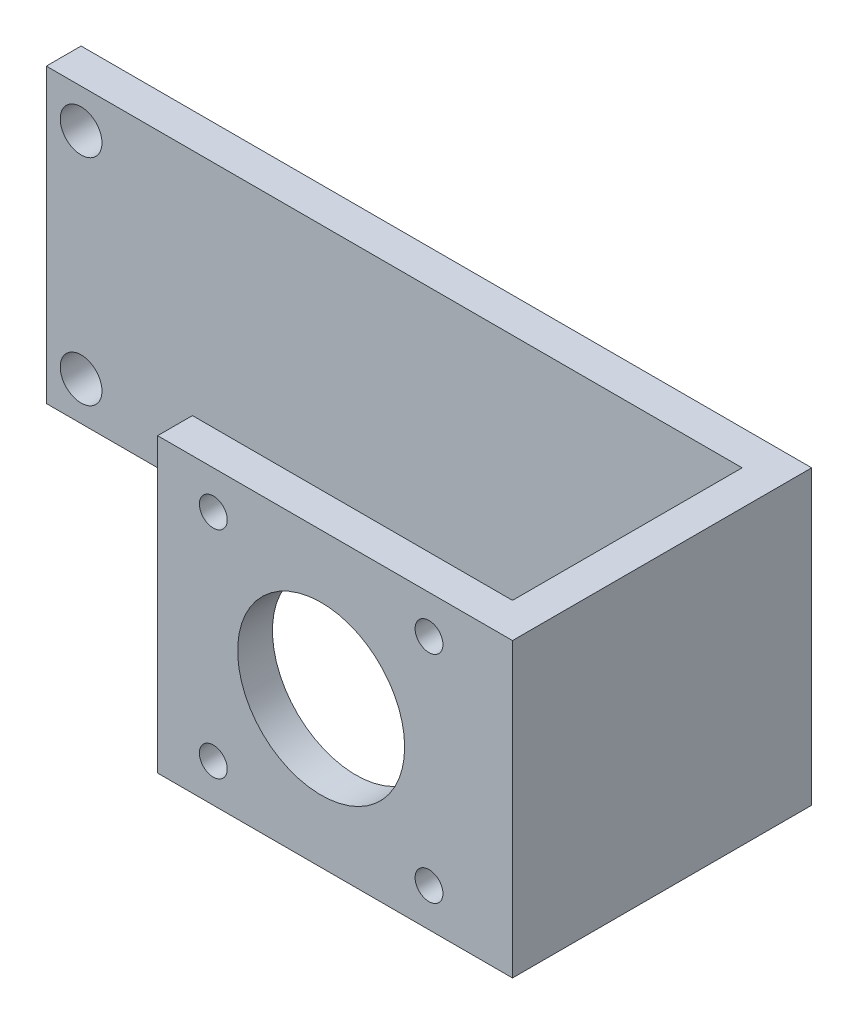
ISO-10303-21;
HEADER;
FILE_DESCRIPTION(('STEP AP214'),'2;1');
FILE_NAME('part.step','',(''),(''),'','','');
FILE_SCHEMA(('AUTOMOTIVE_DESIGN { 1 0 10303 214 1 1 1 1 }'));
ENDSEC;
DATA;
#1=APPLICATION_CONTEXT('core data for automotive mechanical design processes');
#2=APPLICATION_PROTOCOL_DEFINITION('international standard','automotive_design',2000,#1);
#3=PRODUCT_CONTEXT('',#1,'mechanical');
#4=PRODUCT('Part','Part','',(#3));
#5=PRODUCT_RELATED_PRODUCT_CATEGORY('part','',(#4));
#6=PRODUCT_DEFINITION_FORMATION('','',#4);
#7=PRODUCT_DEFINITION_CONTEXT('part definition',#1,'design');
#8=PRODUCT_DEFINITION('design','',#6,#7);
#9=PRODUCT_DEFINITION_SHAPE('','',#8);
#10=(LENGTH_UNIT() NAMED_UNIT(*) SI_UNIT(.MILLI.,.METRE.));
#11=(NAMED_UNIT(*) PLANE_ANGLE_UNIT() SI_UNIT($,.RADIAN.));
#12=(NAMED_UNIT(*) SI_UNIT($,.STERADIAN.) SOLID_ANGLE_UNIT());
#13=UNCERTAINTY_MEASURE_WITH_UNIT(LENGTH_MEASURE(1.E-05),#10,'distance_accuracy_value','');
#14=(GEOMETRIC_REPRESENTATION_CONTEXT(3) GLOBAL_UNCERTAINTY_ASSIGNED_CONTEXT((#13)) GLOBAL_UNIT_ASSIGNED_CONTEXT((#10,
#11,#12)) REPRESENTATION_CONTEXT('',''));
#15=CARTESIAN_POINT('',(0.,0.,0.));
#16=DIRECTION('',(0.,0.,1.));
#17=DIRECTION('',(1.,0.,0.));
#18=AXIS2_PLACEMENT_3D('',#15,#16,#17);
#19=CARTESIAN_POINT('',(47.5,-21.,43.));
#20=DIRECTION('',(1.,0.,0.));
#21=DIRECTION('',(0.,0.,-1.));
#22=AXIS2_PLACEMENT_3D('',#19,#20,#21);
#23=PLANE('',#22);
#24=DIRECTION('',(0.,-1.,0.));
#25=VECTOR('',#24,1.);
#26=CARTESIAN_POINT('',(47.5,-21.,38.));
#27=LINE('',#26,#25);
#28=CARTESIAN_POINT('',(47.5,21.,38.));
#29=VERTEX_POINT('',#28);
#30=CARTESIAN_POINT('',(47.5,-21.,38.));
#31=VERTEX_POINT('',#30);
#32=EDGE_CURVE('E166',#29,#31,#27,.T.);
#33=ORIENTED_EDGE('',*,*,#32,.F.);
#34=DIRECTION('',(0.,0.,-1.));
#35=VECTOR('',#34,1.);
#36=CARTESIAN_POINT('',(47.5,21.,43.));
#37=LINE('',#36,#35);
#38=CARTESIAN_POINT('',(47.5,21.,5.));
#39=VERTEX_POINT('',#38);
#40=EDGE_CURVE('E38',#29,#39,#37,.T.);
#41=ORIENTED_EDGE('',*,*,#40,.T.);
#42=DIRECTION('',(0.,-1.,0.));
#43=VECTOR('',#42,1.);
#44=CARTESIAN_POINT('',(47.5,-21.,5.));
#45=LINE('',#44,#43);
#46=CARTESIAN_POINT('',(47.5,-21.,5.));
#47=VERTEX_POINT('',#46);
#48=EDGE_CURVE('E145',#39,#47,#45,.T.);
#49=ORIENTED_EDGE('',*,*,#48,.T.);
#50=DIRECTION('',(0.,0.,-1.));
#51=VECTOR('',#50,1.);
#52=CARTESIAN_POINT('',(47.5,-21.,43.));
#53=LINE('',#52,#51);
#54=EDGE_CURVE('E134',#31,#47,#53,.T.);
#55=ORIENTED_EDGE('',*,*,#54,.F.);
#56=EDGE_LOOP('',(#33,#41,#49,#55));
#57=FACE_BOUND('',#56,.T.);
#58=ADVANCED_FACE('F34',(#57),#23,.F.);
#59=CARTESIAN_POINT('',(0.,21.,5.));
#60=DIRECTION('',(0.,1.,0.));
#61=DIRECTION('',(-1.,0.,0.));
#62=AXIS2_PLACEMENT_3D('',#59,#60,#61);
#63=PLANE('',#62);
#64=DIRECTION('',(1.,0.,0.));
#65=VECTOR('',#64,1.);
#66=CARTESIAN_POINT('',(0.,21.,0.));
#67=LINE('',#66,#65);
#68=CARTESIAN_POINT('',(-52.5,21.,0.));
#69=VERTEX_POINT('',#68);
#70=CARTESIAN_POINT('',(52.5,21.,0.));
#71=VERTEX_POINT('',#70);
#72=EDGE_CURVE('E83',#69,#71,#67,.T.);
#73=ORIENTED_EDGE('',*,*,#72,.F.);
#74=DIRECTION('',(0.,0.,-1.));
#75=VECTOR('',#74,1.);
#76=CARTESIAN_POINT('',(-52.5,21.,5.));
#77=LINE('',#76,#75);
#78=CARTESIAN_POINT('',(-52.5,21.,5.));
#79=VERTEX_POINT('',#78);
#80=EDGE_CURVE('E11',#79,#69,#77,.T.);
#81=ORIENTED_EDGE('',*,*,#80,.F.);
#82=DIRECTION('',(1.,0.,0.));
#83=VECTOR('',#82,1.);
#84=CARTESIAN_POINT('',(0.,21.,5.));
#85=LINE('',#84,#83);
#86=EDGE_CURVE('E118',#79,#39,#85,.T.);
#87=ORIENTED_EDGE('',*,*,#86,.T.);
#88=ORIENTED_EDGE('',*,*,#40,.F.);
#89=DIRECTION('',(1.,0.,0.));
#90=VECTOR('',#89,1.);
#91=CARTESIAN_POINT('',(1.49999999999996,21.,38.));
#92=LINE('',#91,#90);
#93=CARTESIAN_POINT('',(1.49999999999996,21.,38.));
#94=VERTEX_POINT('',#93);
#95=EDGE_CURVE('E155',#94,#29,#92,.T.);
#96=ORIENTED_EDGE('',*,*,#95,.F.);
#97=DIRECTION('',(0.,0.,-1.));
#98=VECTOR('',#97,1.);
#99=CARTESIAN_POINT('',(1.49999999999996,21.,38.));
#100=LINE('',#99,#98);
#101=CARTESIAN_POINT('',(1.49999999999996,21.,43.));
#102=VERTEX_POINT('',#101);
#103=EDGE_CURVE('E165',#102,#94,#100,.T.);
#104=ORIENTED_EDGE('',*,*,#103,.F.);
#105=DIRECTION('',(-1.,0.,0.));
#106=VECTOR('',#105,1.);
#107=CARTESIAN_POINT('',(47.5,21.,43.));
#108=LINE('',#107,#106);
#109=CARTESIAN_POINT('',(52.5,21.,43.));
#110=VERTEX_POINT('',#109);
#111=EDGE_CURVE('E86',#110,#102,#108,.T.);
#112=ORIENTED_EDGE('',*,*,#111,.F.);
#113=DIRECTION('',(0.,0.,-1.));
#114=VECTOR('',#113,1.);
#115=CARTESIAN_POINT('',(52.5,21.,5.));
#116=LINE('',#115,#114);
#117=EDGE_CURVE('E80',#110,#71,#116,.T.);
#118=ORIENTED_EDGE('',*,*,#117,.T.);
#119=EDGE_LOOP('',(#73,#81,#87,#88,#96,#104,#112,#118));
#120=FACE_BOUND('',#119,.T.);
#121=ADVANCED_FACE('F82',(#120),#63,.T.);
#122=CARTESIAN_POINT('',(-52.5,0.,5.));
#123=DIRECTION('',(1.,0.,0.));
#124=DIRECTION('',(0.,0.,-1.));
#125=AXIS2_PLACEMENT_3D('',#122,#123,#124);
#126=PLANE('',#125);
#127=DIRECTION('',(0.,-1.,0.));
#128=VECTOR('',#127,1.);
#129=CARTESIAN_POINT('',(-52.5,0.,0.));
#130=LINE('',#129,#128);
#131=CARTESIAN_POINT('',(-52.5,-21.,0.));
#132=VERTEX_POINT('',#131);
#133=EDGE_CURVE('E101',#69,#132,#130,.T.);
#134=ORIENTED_EDGE('',*,*,#133,.T.);
#135=DIRECTION('',(0.,0.,-1.));
#136=VECTOR('',#135,1.);
#137=CARTESIAN_POINT('',(-52.5,-21.,5.));
#138=LINE('',#137,#136);
#139=CARTESIAN_POINT('',(-52.5,-21.,5.));
#140=VERTEX_POINT('',#139);
#141=EDGE_CURVE('E44',#140,#132,#138,.T.);
#142=ORIENTED_EDGE('',*,*,#141,.F.);
#143=DIRECTION('',(0.,-1.,0.));
#144=VECTOR('',#143,1.);
#145=CARTESIAN_POINT('',(-52.5,0.,5.));
#146=LINE('',#145,#144);
#147=EDGE_CURVE('E122',#79,#140,#146,.T.);
#148=ORIENTED_EDGE('',*,*,#147,.F.);
#149=ORIENTED_EDGE('',*,*,#80,.T.);
#150=EDGE_LOOP('',(#134,#142,#148,#149));
#151=FACE_BOUND('',#150,.T.);
#152=ADVANCED_FACE('F137',(#151),#126,.F.);
#153=CARTESIAN_POINT('',(0.,-21.,5.));
#154=DIRECTION('',(0.,1.,0.));
#155=DIRECTION('',(0.,0.,1.));
#156=AXIS2_PLACEMENT_3D('',#153,#154,#155);
#157=PLANE('',#156);
#158=DIRECTION('',(1.,0.,0.));
#159=VECTOR('',#158,1.);
#160=CARTESIAN_POINT('',(0.,-21.,0.));
#161=LINE('',#160,#159);
#162=CARTESIAN_POINT('',(52.5,-21.,0.));
#163=VERTEX_POINT('',#162);
#164=EDGE_CURVE('E108',#132,#163,#161,.T.);
#165=ORIENTED_EDGE('',*,*,#164,.T.);
#166=DIRECTION('',(0.,0.,-1.));
#167=VECTOR('',#166,1.);
#168=CARTESIAN_POINT('',(52.5,-21.,5.));
#169=LINE('',#168,#167);
#170=CARTESIAN_POINT('',(52.5,-21.,43.));
#171=VERTEX_POINT('',#170);
#172=EDGE_CURVE('E91',#171,#163,#169,.T.);
#173=ORIENTED_EDGE('',*,*,#172,.F.);
#174=DIRECTION('',(1.,0.,0.));
#175=VECTOR('',#174,1.);
#176=CARTESIAN_POINT('',(47.5,-21.,43.));
#177=LINE('',#176,#175);
#178=CARTESIAN_POINT('',(1.49999999999996,-21.,43.));
#179=VERTEX_POINT('',#178);
#180=EDGE_CURVE('E148',#179,#171,#177,.T.);
#181=ORIENTED_EDGE('',*,*,#180,.F.);
#182=DIRECTION('',(0.,0.,1.));
#183=VECTOR('',#182,1.);
#184=CARTESIAN_POINT('',(1.49999999999996,-21.,38.));
#185=LINE('',#184,#183);
#186=CARTESIAN_POINT('',(1.49999999999996,-21.,38.));
#187=VERTEX_POINT('',#186);
#188=EDGE_CURVE('E176',#187,#179,#185,.T.);
#189=ORIENTED_EDGE('',*,*,#188,.F.);
#190=DIRECTION('',(1.,0.,0.));
#191=VECTOR('',#190,1.);
#192=CARTESIAN_POINT('',(1.49999999999996,-21.,38.));
#193=LINE('',#192,#191);
#194=EDGE_CURVE('E149',#187,#31,#193,.T.);
#195=ORIENTED_EDGE('',*,*,#194,.T.);
#196=ORIENTED_EDGE('',*,*,#54,.T.);
#197=DIRECTION('',(1.,0.,0.));
#198=VECTOR('',#197,1.);
#199=CARTESIAN_POINT('',(0.,-21.,5.));
#200=LINE('',#199,#198);
#201=EDGE_CURVE('E60',#140,#47,#200,.T.);
#202=ORIENTED_EDGE('',*,*,#201,.F.);
#203=ORIENTED_EDGE('',*,*,#141,.T.);
#204=EDGE_LOOP('',(#165,#173,#181,#189,#195,#196,#202,#203));
#205=FACE_BOUND('',#204,.T.);
#206=ADVANCED_FACE('F233',(#205),#157,.F.);
#207=CARTESIAN_POINT('',(52.5,0.,5.));
#208=DIRECTION('',(1.,0.,0.));
#209=DIRECTION('',(0.,1.,0.));
#210=AXIS2_PLACEMENT_3D('',#207,#208,#209);
#211=PLANE('',#210);
#212=DIRECTION('',(0.,-1.,0.));
#213=VECTOR('',#212,1.);
#214=CARTESIAN_POINT('',(52.5,0.,0.));
#215=LINE('',#214,#213);
#216=EDGE_CURVE('E99',#71,#163,#215,.T.);
#217=ORIENTED_EDGE('',*,*,#216,.F.);
#218=ORIENTED_EDGE('',*,*,#117,.F.);
#219=DIRECTION('',(0.,1.,0.));
#220=VECTOR('',#219,1.);
#221=CARTESIAN_POINT('',(52.5,-21.,43.));
#222=LINE('',#221,#220);
#223=EDGE_CURVE('E152',#171,#110,#222,.T.);
#224=ORIENTED_EDGE('',*,*,#223,.F.);
#225=ORIENTED_EDGE('',*,*,#172,.T.);
#226=EDGE_LOOP('',(#217,#218,#224,#225));
#227=FACE_BOUND('',#226,.T.);
#228=ADVANCED_FACE('F104',(#227),#211,.T.);
#229=CARTESIAN_POINT('',(-47.5,-15.44,5.));
#230=DIRECTION('',(0.,0.,-1.));
#231=DIRECTION('',(-1.,0.,0.));
#232=AXIS2_PLACEMENT_3D('',#229,#230,#231);
#233=CYLINDRICAL_SURFACE('',#232,3.);
#234=CARTESIAN_POINT('',(-47.5,-15.44,5.));
#235=DIRECTION('',(0.,0.,1.));
#236=DIRECTION('',(1.,0.,0.));
#237=AXIS2_PLACEMENT_3D('',#234,#235,#236);
#238=CIRCLE('',#237,3.);
#239=CARTESIAN_POINT('',(-44.5,-15.44,5.));
#240=VERTEX_POINT('',#239);
#241=EDGE_CURVE('E111',#240,#240,#238,.T.);
#242=ORIENTED_EDGE('',*,*,#241,.T.);
#243=EDGE_LOOP('',(#242));
#244=FACE_BOUND('',#243,.T.);
#245=CARTESIAN_POINT('',(-47.5,-15.44,0.));
#246=DIRECTION('',(0.,0.,1.));
#247=DIRECTION('',(1.,0.,0.));
#248=AXIS2_PLACEMENT_3D('',#245,#246,#247);
#249=CIRCLE('',#248,3.);
#250=CARTESIAN_POINT('',(-44.5,-15.44,0.));
#251=VERTEX_POINT('',#250);
#252=EDGE_CURVE('E102',#251,#251,#249,.T.);
#253=ORIENTED_EDGE('',*,*,#252,.F.);
#254=EDGE_LOOP('',(#253));
#255=FACE_BOUND('',#254,.T.);
#256=ADVANCED_FACE('F36',(#244,#255),#233,.F.);
#257=CARTESIAN_POINT('',(-47.5,15.44,5.));
#258=DIRECTION('',(0.,0.,-1.));
#259=DIRECTION('',(-1.,0.,0.));
#260=AXIS2_PLACEMENT_3D('',#257,#258,#259);
#261=CYLINDRICAL_SURFACE('',#260,2.99999999999999);
#262=CARTESIAN_POINT('',(-47.5,15.44,5.));
#263=DIRECTION('',(0.,0.,1.));
#264=DIRECTION('',(1.,0.,0.));
#265=AXIS2_PLACEMENT_3D('',#262,#263,#264);
#266=CIRCLE('',#265,2.99999999999999);
#267=CARTESIAN_POINT('',(-44.5,15.44,5.));
#268=VERTEX_POINT('',#267);
#269=EDGE_CURVE('E92',#268,#268,#266,.T.);
#270=ORIENTED_EDGE('',*,*,#269,.T.);
#271=EDGE_LOOP('',(#270));
#272=FACE_BOUND('',#271,.T.);
#273=CARTESIAN_POINT('',(-47.5,15.44,0.));
#274=DIRECTION('',(0.,0.,1.));
#275=DIRECTION('',(1.,0.,0.));
#276=AXIS2_PLACEMENT_3D('',#273,#274,#275);
#277=CIRCLE('',#276,2.99999999999999);
#278=CARTESIAN_POINT('',(-44.5,15.44,0.));
#279=VERTEX_POINT('',#278);
#280=EDGE_CURVE('E107',#279,#279,#277,.T.);
#281=ORIENTED_EDGE('',*,*,#280,.F.);
#282=EDGE_LOOP('',(#281));
#283=FACE_BOUND('',#282,.T.);
#284=ADVANCED_FACE('F267',(#272,#283),#261,.F.);
#285=CARTESIAN_POINT('',(0.,0.,5.));
#286=DIRECTION('',(0.,0.,1.));
#287=DIRECTION('',(1.,0.,0.));
#288=AXIS2_PLACEMENT_3D('',#285,#286,#287);
#289=PLANE('',#288);
#290=ORIENTED_EDGE('',*,*,#48,.F.);
#291=ORIENTED_EDGE('',*,*,#86,.F.);
#292=ORIENTED_EDGE('',*,*,#147,.T.);
#293=ORIENTED_EDGE('',*,*,#201,.T.);
#294=EDGE_LOOP('',(#290,#291,#292,#293));
#295=FACE_BOUND('',#294,.T.);
#296=ORIENTED_EDGE('',*,*,#241,.F.);
#297=EDGE_LOOP('',(#296));
#298=FACE_BOUND('',#297,.T.);
#299=ORIENTED_EDGE('',*,*,#269,.F.);
#300=EDGE_LOOP('',(#299));
#301=FACE_BOUND('',#300,.T.);
#302=ADVANCED_FACE('F143',(#295,#298,#301),#289,.T.);
#303=CARTESIAN_POINT('',(0.,0.,0.));
#304=DIRECTION('',(0.,0.,1.));
#305=DIRECTION('',(1.,0.,0.));
#306=AXIS2_PLACEMENT_3D('',#303,#304,#305);
#307=PLANE('',#306);
#308=ORIENTED_EDGE('',*,*,#252,.T.);
#309=EDGE_LOOP('',(#308));
#310=FACE_BOUND('',#309,.T.);
#311=ORIENTED_EDGE('',*,*,#72,.T.);
#312=ORIENTED_EDGE('',*,*,#216,.T.);
#313=ORIENTED_EDGE('',*,*,#164,.F.);
#314=ORIENTED_EDGE('',*,*,#133,.F.);
#315=EDGE_LOOP('',(#311,#312,#313,#314));
#316=FACE_BOUND('',#315,.T.);
#317=ORIENTED_EDGE('',*,*,#280,.T.);
#318=EDGE_LOOP('',(#317));
#319=FACE_BOUND('',#318,.T.);
#320=ADVANCED_FACE('F97',(#310,#316,#319),#307,.F.);
#321=CARTESIAN_POINT('',(0.,0.,43.));
#322=DIRECTION('',(0.,0.,-1.));
#323=DIRECTION('',(-1.,0.,0.));
#324=AXIS2_PLACEMENT_3D('',#321,#322,#323);
#325=PLANE('',#324);
#326=CARTESIAN_POINT('',(40.5,15.5,43.));
#327=DIRECTION('',(0.,0.,1.));
#328=DIRECTION('',(1.,0.,0.));
#329=AXIS2_PLACEMENT_3D('',#326,#327,#328);
#330=CIRCLE('',#329,2.);
#331=CARTESIAN_POINT('',(42.5,15.5,43.));
#332=VERTEX_POINT('',#331);
#333=EDGE_CURVE('E204',#332,#332,#330,.T.);
#334=ORIENTED_EDGE('',*,*,#333,.F.);
#335=EDGE_LOOP('',(#334));
#336=FACE_BOUND('',#335,.T.);
#337=CARTESIAN_POINT('',(40.5,-15.5,43.));
#338=DIRECTION('',(0.,0.,1.));
#339=DIRECTION('',(1.,0.,0.));
#340=AXIS2_PLACEMENT_3D('',#337,#338,#339);
#341=CIRCLE('',#340,2.);
#342=CARTESIAN_POINT('',(42.5,-15.5,43.));
#343=VERTEX_POINT('',#342);
#344=EDGE_CURVE('E198',#343,#343,#341,.T.);
#345=ORIENTED_EDGE('',*,*,#344,.F.);
#346=EDGE_LOOP('',(#345));
#347=FACE_BOUND('',#346,.T.);
#348=CARTESIAN_POINT('',(25.,0.,43.));
#349=DIRECTION('',(0.,0.,1.));
#350=DIRECTION('',(1.,0.,0.));
#351=AXIS2_PLACEMENT_3D('',#348,#349,#350);
#352=CIRCLE('',#351,12.);
#353=CARTESIAN_POINT('',(37.,0.,43.));
#354=VERTEX_POINT('',#353);
#355=EDGE_CURVE('E192',#354,#354,#352,.T.);
#356=ORIENTED_EDGE('',*,*,#355,.F.);
#357=EDGE_LOOP('',(#356));
#358=FACE_BOUND('',#357,.T.);
#359=CARTESIAN_POINT('',(9.49999999999996,-15.5,43.));
#360=DIRECTION('',(0.,0.,1.));
#361=DIRECTION('',(1.,0.,0.));
#362=AXIS2_PLACEMENT_3D('',#359,#360,#361);
#363=CIRCLE('',#362,2.);
#364=CARTESIAN_POINT('',(11.5,-15.5,43.));
#365=VERTEX_POINT('',#364);
#366=EDGE_CURVE('E186',#365,#365,#363,.T.);
#367=ORIENTED_EDGE('',*,*,#366,.F.);
#368=EDGE_LOOP('',(#367));
#369=FACE_BOUND('',#368,.T.);
#370=CARTESIAN_POINT('',(9.49999999999995,15.5,43.));
#371=DIRECTION('',(0.,0.,1.));
#372=DIRECTION('',(1.,0.,0.));
#373=AXIS2_PLACEMENT_3D('',#370,#371,#372);
#374=CIRCLE('',#373,2.);
#375=CARTESIAN_POINT('',(11.5,15.5,43.));
#376=VERTEX_POINT('',#375);
#377=EDGE_CURVE('E183',#376,#376,#374,.T.);
#378=ORIENTED_EDGE('',*,*,#377,.F.);
#379=EDGE_LOOP('',(#378));
#380=FACE_BOUND('',#379,.T.);
#381=ORIENTED_EDGE('',*,*,#111,.T.);
#382=DIRECTION('',(0.,1.,0.));
#383=VECTOR('',#382,1.);
#384=CARTESIAN_POINT('',(1.49999999999996,-21.,43.));
#385=LINE('',#384,#383);
#386=EDGE_CURVE('E173',#179,#102,#385,.T.);
#387=ORIENTED_EDGE('',*,*,#386,.F.);
#388=ORIENTED_EDGE('',*,*,#180,.T.);
#389=ORIENTED_EDGE('',*,*,#223,.T.);
#390=EDGE_LOOP('',(#381,#387,#388,#389));
#391=FACE_BOUND('',#390,.T.);
#392=ADVANCED_FACE('F218',(#336,#347,#358,#369,#380,#391),#325,.F.);
#393=CARTESIAN_POINT('',(1.49999999999996,-21.,38.));
#394=DIRECTION('',(0.,0.,1.));
#395=DIRECTION('',(1.,0.,0.));
#396=AXIS2_PLACEMENT_3D('',#393,#394,#395);
#397=PLANE('',#396);
#398=CARTESIAN_POINT('',(40.5,15.5,38.));
#399=DIRECTION('',(0.,0.,1.));
#400=DIRECTION('',(1.,0.,0.));
#401=AXIS2_PLACEMENT_3D('',#398,#399,#400);
#402=CIRCLE('',#401,2.);
#403=CARTESIAN_POINT('',(42.5,15.5,38.));
#404=VERTEX_POINT('',#403);
#405=EDGE_CURVE('E207',#404,#404,#402,.F.);
#406=ORIENTED_EDGE('',*,*,#405,.F.);
#407=EDGE_LOOP('',(#406));
#408=FACE_BOUND('',#407,.T.);
#409=CARTESIAN_POINT('',(40.5,-15.5,38.));
#410=DIRECTION('',(0.,0.,1.));
#411=DIRECTION('',(1.,0.,0.));
#412=AXIS2_PLACEMENT_3D('',#409,#410,#411);
#413=CIRCLE('',#412,2.);
#414=CARTESIAN_POINT('',(42.5,-15.5,38.));
#415=VERTEX_POINT('',#414);
#416=EDGE_CURVE('E201',#415,#415,#413,.F.);
#417=ORIENTED_EDGE('',*,*,#416,.F.);
#418=EDGE_LOOP('',(#417));
#419=FACE_BOUND('',#418,.T.);
#420=CARTESIAN_POINT('',(25.,0.,38.));
#421=DIRECTION('',(0.,0.,1.));
#422=DIRECTION('',(1.,0.,0.));
#423=AXIS2_PLACEMENT_3D('',#420,#421,#422);
#424=CIRCLE('',#423,12.);
#425=CARTESIAN_POINT('',(37.,0.,38.));
#426=VERTEX_POINT('',#425);
#427=EDGE_CURVE('E195',#426,#426,#424,.F.);
#428=ORIENTED_EDGE('',*,*,#427,.F.);
#429=EDGE_LOOP('',(#428));
#430=FACE_BOUND('',#429,.T.);
#431=CARTESIAN_POINT('',(9.49999999999996,-15.5,38.));
#432=DIRECTION('',(0.,0.,1.));
#433=DIRECTION('',(1.,0.,0.));
#434=AXIS2_PLACEMENT_3D('',#431,#432,#433);
#435=CIRCLE('',#434,2.);
#436=CARTESIAN_POINT('',(11.5,-15.5,38.));
#437=VERTEX_POINT('',#436);
#438=EDGE_CURVE('E189',#437,#437,#435,.F.);
#439=ORIENTED_EDGE('',*,*,#438,.F.);
#440=EDGE_LOOP('',(#439));
#441=FACE_BOUND('',#440,.T.);
#442=CARTESIAN_POINT('',(9.49999999999995,15.5,38.));
#443=DIRECTION('',(0.,0.,1.));
#444=DIRECTION('',(1.,0.,0.));
#445=AXIS2_PLACEMENT_3D('',#442,#443,#444);
#446=CIRCLE('',#445,2.);
#447=CARTESIAN_POINT('',(11.5,15.5,38.));
#448=VERTEX_POINT('',#447);
#449=EDGE_CURVE('E170',#448,#448,#446,.F.);
#450=ORIENTED_EDGE('',*,*,#449,.F.);
#451=EDGE_LOOP('',(#450));
#452=FACE_BOUND('',#451,.T.);
#453=ORIENTED_EDGE('',*,*,#32,.T.);
#454=ORIENTED_EDGE('',*,*,#194,.F.);
#455=DIRECTION('',(0.,-1.,0.));
#456=VECTOR('',#455,1.);
#457=CARTESIAN_POINT('',(1.49999999999996,-21.,38.));
#458=LINE('',#457,#456);
#459=EDGE_CURVE('E169',#94,#187,#458,.T.);
#460=ORIENTED_EDGE('',*,*,#459,.F.);
#461=ORIENTED_EDGE('',*,*,#95,.T.);
#462=EDGE_LOOP('',(#453,#454,#460,#461));
#463=FACE_BOUND('',#462,.T.);
#464=ADVANCED_FACE('F214',(#408,#419,#430,#441,#452,#463),#397,.F.);
#465=CARTESIAN_POINT('',(1.49999999999996,0.,0.));
#466=DIRECTION('',(1.,0.,0.));
#467=DIRECTION('',(0.,0.,-1.));
#468=AXIS2_PLACEMENT_3D('',#465,#466,#467);
#469=PLANE('',#468);
#470=ORIENTED_EDGE('',*,*,#459,.T.);
#471=ORIENTED_EDGE('',*,*,#188,.T.);
#472=ORIENTED_EDGE('',*,*,#386,.T.);
#473=ORIENTED_EDGE('',*,*,#103,.T.);
#474=EDGE_LOOP('',(#470,#471,#472,#473));
#475=FACE_BOUND('',#474,.T.);
#476=ADVANCED_FACE('F217',(#475),#469,.F.);
#477=CARTESIAN_POINT('',(9.49999999999995,15.5,4.05887450304573));
#478=DIRECTION('',(0.,0.,1.));
#479=DIRECTION('',(1.,0.,0.));
#480=AXIS2_PLACEMENT_3D('',#477,#478,#479);
#481=CYLINDRICAL_SURFACE('',#480,2.);
#482=ORIENTED_EDGE('',*,*,#449,.T.);
#483=EDGE_LOOP('',(#482));
#484=FACE_BOUND('',#483,.T.);
#485=ORIENTED_EDGE('',*,*,#377,.T.);
#486=EDGE_LOOP('',(#485));
#487=FACE_BOUND('',#486,.T.);
#488=ADVANCED_FACE('F360',(#484,#487),#481,.F.);
#489=CARTESIAN_POINT('',(9.49999999999996,-15.5,4.05887450304573));
#490=DIRECTION('',(0.,0.,1.));
#491=DIRECTION('',(1.,0.,0.));
#492=AXIS2_PLACEMENT_3D('',#489,#490,#491);
#493=CYLINDRICAL_SURFACE('',#492,2.);
#494=ORIENTED_EDGE('',*,*,#438,.T.);
#495=EDGE_LOOP('',(#494));
#496=FACE_BOUND('',#495,.T.);
#497=ORIENTED_EDGE('',*,*,#366,.T.);
#498=EDGE_LOOP('',(#497));
#499=FACE_BOUND('',#498,.T.);
#500=ADVANCED_FACE('F367',(#496,#499),#493,.F.);
#501=CARTESIAN_POINT('',(25.,0.,4.05887450304573));
#502=DIRECTION('',(0.,0.,1.));
#503=DIRECTION('',(1.,0.,0.));
#504=AXIS2_PLACEMENT_3D('',#501,#502,#503);
#505=CYLINDRICAL_SURFACE('',#504,12.);
#506=ORIENTED_EDGE('',*,*,#427,.T.);
#507=EDGE_LOOP('',(#506));
#508=FACE_BOUND('',#507,.T.);
#509=ORIENTED_EDGE('',*,*,#355,.T.);
#510=EDGE_LOOP('',(#509));
#511=FACE_BOUND('',#510,.T.);
#512=ADVANCED_FACE('F376',(#508,#511),#505,.F.);
#513=CARTESIAN_POINT('',(40.5,-15.5,4.05887450304573));
#514=DIRECTION('',(0.,0.,1.));
#515=DIRECTION('',(1.,0.,0.));
#516=AXIS2_PLACEMENT_3D('',#513,#514,#515);
#517=CYLINDRICAL_SURFACE('',#516,2.);
#518=ORIENTED_EDGE('',*,*,#416,.T.);
#519=EDGE_LOOP('',(#518));
#520=FACE_BOUND('',#519,.T.);
#521=ORIENTED_EDGE('',*,*,#344,.T.);
#522=EDGE_LOOP('',(#521));
#523=FACE_BOUND('',#522,.T.);
#524=ADVANCED_FACE('F385',(#520,#523),#517,.F.);
#525=CARTESIAN_POINT('',(40.5,15.5,4.05887450304573));
#526=DIRECTION('',(0.,0.,1.));
#527=DIRECTION('',(1.,0.,0.));
#528=AXIS2_PLACEMENT_3D('',#525,#526,#527);
#529=CYLINDRICAL_SURFACE('',#528,2.);
#530=ORIENTED_EDGE('',*,*,#405,.T.);
#531=EDGE_LOOP('',(#530));
#532=FACE_BOUND('',#531,.T.);
#533=ORIENTED_EDGE('',*,*,#333,.T.);
#534=EDGE_LOOP('',(#533));
#535=FACE_BOUND('',#534,.T.);
#536=ADVANCED_FACE('F211',(#532,#535),#529,.F.);
#537=CLOSED_SHELL('',(#58,#121,#152,#206,#228,#256,#284,#302,#320,#392,#464,#476,#488,#500,#512,
#524,#536));
#538=MANIFOLD_SOLID_BREP('B2',#537);
#539=ADVANCED_BREP_SHAPE_REPRESENTATION('',(#18,#538),#14);
#540=SHAPE_DEFINITION_REPRESENTATION(#9,#539);
ENDSEC;
END-ISO-10303-21;
